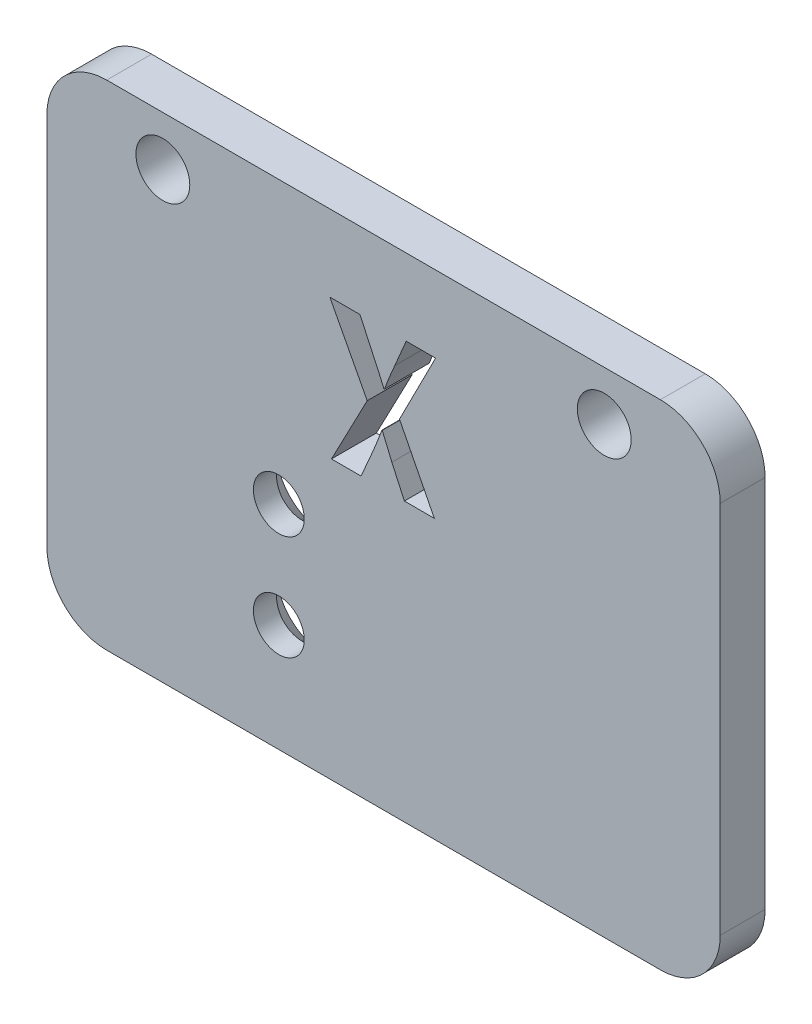
ISO-10303-21;
HEADER;
FILE_DESCRIPTION(('STEP AP214'),'2;1');
FILE_NAME('part.step','',(''),(''),'','','');
FILE_SCHEMA(('AUTOMOTIVE_DESIGN { 1 0 10303 214 1 1 1 1 }'));
ENDSEC;
DATA;
#1=APPLICATION_CONTEXT('core data for automotive mechanical design processes');
#2=APPLICATION_PROTOCOL_DEFINITION('international standard','automotive_design',2000,#1);
#3=PRODUCT_CONTEXT('',#1,'mechanical');
#4=PRODUCT('Part','Part','',(#3));
#5=PRODUCT_RELATED_PRODUCT_CATEGORY('part','',(#4));
#6=PRODUCT_DEFINITION_FORMATION('','',#4);
#7=PRODUCT_DEFINITION_CONTEXT('part definition',#1,'design');
#8=PRODUCT_DEFINITION('design','',#6,#7);
#9=PRODUCT_DEFINITION_SHAPE('','',#8);
#10=(LENGTH_UNIT() NAMED_UNIT(*) SI_UNIT(.MILLI.,.METRE.));
#11=(NAMED_UNIT(*) PLANE_ANGLE_UNIT() SI_UNIT($,.RADIAN.));
#12=(NAMED_UNIT(*) SI_UNIT($,.STERADIAN.) SOLID_ANGLE_UNIT());
#13=UNCERTAINTY_MEASURE_WITH_UNIT(LENGTH_MEASURE(1.E-05),#10,'distance_accuracy_value','');
#14=(GEOMETRIC_REPRESENTATION_CONTEXT(3) GLOBAL_UNCERTAINTY_ASSIGNED_CONTEXT((#13)) GLOBAL_UNIT_ASSIGNED_CONTEXT((#10,
#11,#12)) REPRESENTATION_CONTEXT('',''));
#15=CARTESIAN_POINT('',(0.,0.,0.));
#16=DIRECTION('',(0.,0.,1.));
#17=DIRECTION('',(1.,0.,0.));
#18=AXIS2_PLACEMENT_3D('',#15,#16,#17);
#19=CARTESIAN_POINT('',(0.,0.,3.));
#20=DIRECTION('',(0.,0.,1.));
#21=DIRECTION('',(1.,0.,0.));
#22=AXIS2_PLACEMENT_3D('',#19,#20,#21);
#23=PLANE('',#22);
#24=CARTESIAN_POINT('',(-7.00000000000006,-6.49999999999997,3.));
#25=DIRECTION('',(0.,0.,-1.));
#26=DIRECTION('',(-1.,0.,0.));
#27=AXIS2_PLACEMENT_3D('',#24,#25,#26);
#28=CIRCLE('',#27,1.7);
#29=CARTESIAN_POINT('',(-8.70000000000005,-6.49999999999997,3.));
#30=VERTEX_POINT('',#29);
#31=EDGE_CURVE('E816',#30,#30,#28,.T.);
#32=ORIENTED_EDGE('',*,*,#31,.T.);
#33=EDGE_LOOP('',(#32));
#34=FACE_BOUND('',#33,.T.);
#35=CARTESIAN_POINT('',(-14.75,16.0000000000112,3.));
#36=DIRECTION('',(0.,0.,1.));
#37=DIRECTION('',(1.,0.,0.));
#38=AXIS2_PLACEMENT_3D('',#35,#36,#37);
#39=CIRCLE('',#38,1.8);
#40=CARTESIAN_POINT('',(-12.95,16.0000000000112,3.));
#41=VERTEX_POINT('',#40);
#42=EDGE_CURVE('E831',#41,#41,#39,.T.);
#43=ORIENTED_EDGE('',*,*,#42,.F.);
#44=EDGE_LOOP('',(#43));
#45=FACE_BOUND('',#44,.T.);
#46=DIRECTION('',(1.,0.,0.));
#47=VECTOR('',#46,1.);
#48=CARTESIAN_POINT('',(-3.47999494411554,4.87964303541985,3.));
#49=LINE('',#48,#47);
#50=CARTESIAN_POINT('',(-3.47999494411554,4.87964303541985,3.));
#51=VERTEX_POINT('',#50);
#52=CARTESIAN_POINT('',(-1.50445461349458,4.87964303541985,3.));
#53=VERTEX_POINT('',#52);
#54=EDGE_CURVE('E217',#51,#53,#49,.T.);
#55=ORIENTED_EDGE('',*,*,#54,.F.);
#56=DIRECTION('',(-0.463406562768989,-0.886145787995762,0.));
#57=VECTOR('',#56,1.);
#58=CARTESIAN_POINT('',(-1.09237871630984,9.44534458910088,3.));
#59=LINE('',#58,#57);
#60=CARTESIAN_POINT('',(-1.09237871630984,9.44534458910088,3.));
#61=VERTEX_POINT('',#60);
#62=EDGE_CURVE('E207',#61,#51,#59,.T.);
#63=ORIENTED_EDGE('',*,*,#62,.F.);
#64=DIRECTION('',(0.465445905386361,-0.885076329566592,0.));
#65=VECTOR('',#64,1.);
#66=CARTESIAN_POINT('',(-3.58907385807621,14.1929763687532,3.));
#67=LINE('',#66,#65);
#68=CARTESIAN_POINT('',(-3.58907385807621,14.1929763687532,3.));
#69=VERTEX_POINT('',#68);
#70=EDGE_CURVE('E402',#69,#61,#67,.T.);
#71=ORIENTED_EDGE('',*,*,#70,.F.);
#72=DIRECTION('',(-1.,0.,0.));
#73=VECTOR('',#72,1.);
#74=CARTESIAN_POINT('',(-1.57717388946836,14.1929763687532,3.));
#75=LINE('',#74,#73);
#76=CARTESIAN_POINT('',(-1.57717388946836,14.1929763687532,3.));
#77=VERTEX_POINT('',#76);
#78=EDGE_CURVE('E475',#77,#69,#75,.T.);
#79=ORIENTED_EDGE('',*,*,#78,.F.);
#80=DIRECTION('',(-0.420330012233321,0.907371302618689,0.));
#81=VECTOR('',#80,1.);
#82=CARTESIAN_POINT('',(-0.740993097717341,12.3879031354512,3.));
#83=LINE('',#82,#81);
#84=CARTESIAN_POINT('',(-0.740993097717341,12.3879031354512,3.));
#85=VERTEX_POINT('',#84);
#86=EDGE_CURVE('E478',#85,#77,#83,.T.);
#87=ORIENTED_EDGE('',*,*,#86,.F.);
#88=CARTESIAN_POINT('',(0.0226501819547567,10.6928090618156,3.));
#89=CARTESIAN_POINT('',(-0.0350807577726407,10.8288788891608,3.));
#90=CARTESIAN_POINT('',(-0.15065561203542,11.1012848215643,3.));
#91=CARTESIAN_POINT('',(-0.32942300897568,11.5147460779507,3.));
#92=CARTESIAN_POINT('',(-0.526398164580095,11.9437350966133,3.));
#93=CARTESIAN_POINT('',(-0.667307197441242,12.2353882492087,3.));
#94=CARTESIAN_POINT('',(-0.740993097717341,12.3879031354512,3.));
#95=B_SPLINE_CURVE_WITH_KNOTS('',3,(#88,#89,#90,#91,#92,#93,#94),.UNSPECIFIED.,.F.,.F.,(4,1,1,1,
4),(0.,0.23847556166915,0.47741780084114,0.726724830683997,1.),.UNSPECIFIED.);
#96=CARTESIAN_POINT('',(0.0226501819547567,10.6928090618156,3.));
#97=VERTEX_POINT('',#96);
#98=EDGE_CURVE('E480',#97,#85,#95,.T.);
#99=ORIENTED_EDGE('',*,*,#98,.F.);
#100=DIRECTION('',(-0.999503272313926,0.0315152127353341,0.));
#101=VECTOR('',#100,1.);
#102=CARTESIAN_POINT('',(0.0579449578783624,10.6916961866481,3.));
#103=LINE('',#102,#101);
#104=CARTESIAN_POINT('',(0.0579449578783624,10.6916961866481,3.));
#105=VERTEX_POINT('',#104);
#106=EDGE_CURVE('E485',#105,#97,#103,.T.);
#107=ORIENTED_EDGE('',*,*,#106,.F.);
#108=CARTESIAN_POINT('',(0.749842941692536,12.4005031458232,3.));
#109=CARTESIAN_POINT('',(0.683388417426678,12.2471747960458,3.));
#110=CARTESIAN_POINT('',(0.555592526506366,11.9523155177706,3.));
#111=CARTESIAN_POINT('',(0.374121285114322,11.5207254866343,3.));
#112=CARTESIAN_POINT('',(0.206338491907835,11.1057202059059,3.));
#113=CARTESIAN_POINT('',(0.107367823790834,10.8295880006152,3.));
#114=CARTESIAN_POINT('',(0.0579449578783624,10.6916961866481,3.));
#115=B_SPLINE_CURVE_WITH_KNOTS('',3,(#108,#109,#110,#111,#112,#113,#114),.UNSPECIFIED.,.F.,.F.,
(4,1,1,1,4),(0.,0.271869227028428,0.522820236330614,0.76171130371579,1.),.UNSPECIFIED.);
#116=CARTESIAN_POINT('',(0.749842941692536,12.4005031458232,3.));
#117=VERTEX_POINT('',#116);
#118=EDGE_CURVE('E508',#117,#105,#115,.T.);
#119=ORIENTED_EDGE('',*,*,#118,.F.);
#120=DIRECTION('',(-0.391901851650741,-0.920007031860475,0.));
#121=VECTOR('',#120,1.);
#122=CARTESIAN_POINT('',(1.5133953394172,14.1929763687532,3.));
#123=LINE('',#122,#121);
#124=CARTESIAN_POINT('',(1.5133953394172,14.1929763687532,3.));
#125=VERTEX_POINT('',#124);
#126=EDGE_CURVE('E513',#125,#117,#123,.T.);
#127=ORIENTED_EDGE('',*,*,#126,.F.);
#128=DIRECTION('',(-1.,0.,0.));
#129=VECTOR('',#128,1.);
#130=CARTESIAN_POINT('',(3.4766991874559,14.1929763687532,3.));
#131=LINE('',#130,#129);
#132=CARTESIAN_POINT('',(3.4766991874559,14.1929763687532,3.));
#133=VERTEX_POINT('',#132);
#134=EDGE_CURVE('E518',#133,#125,#131,.T.);
#135=ORIENTED_EDGE('',*,*,#134,.F.);
#136=DIRECTION('',(0.453821859778633,0.891092430439774,0.));
#137=VECTOR('',#136,1.);
#138=CARTESIAN_POINT('',(1.06495980424557,9.45745589466121,3.));
#139=LINE('',#138,#137);
#140=CARTESIAN_POINT('',(1.06495980424557,9.45745589466121,3.));
#141=VERTEX_POINT('',#140);
#142=EDGE_CURVE('E520',#141,#133,#139,.T.);
#143=ORIENTED_EDGE('',*,*,#142,.F.);
#144=DIRECTION('',(-0.453140743986781,0.89143898621224,0.));
#145=VECTOR('',#144,1.);
#146=CARTESIAN_POINT('',(3.39197663540647,4.87964303541985,3.));
#147=LINE('',#146,#145);
#148=CARTESIAN_POINT('',(3.39197663540647,4.87964303541985,3.));
#149=VERTEX_POINT('',#148);
#150=EDGE_CURVE('E522',#149,#141,#147,.T.);
#151=ORIENTED_EDGE('',*,*,#150,.F.);
#152=DIRECTION('',(1.,0.,0.));
#153=VECTOR('',#152,1.);
#154=CARTESIAN_POINT('',(1.39219654612757,4.87964303541985,3.));
#155=LINE('',#154,#153);
#156=CARTESIAN_POINT('',(1.39219654612757,4.87964303541985,3.));
#157=VERTEX_POINT('',#156);
#158=EDGE_CURVE('E524',#157,#149,#155,.T.);
#159=ORIENTED_EDGE('',*,*,#158,.F.);
#160=DIRECTION('',(0.416466838917006,-0.90915090721094,0.));
#161=VECTOR('',#160,1.);
#162=CARTESIAN_POINT('',(0.554866869380745,6.70754135555651,3.));
#163=LINE('',#162,#161);
#164=CARTESIAN_POINT('',(0.554866869380745,6.70754135555651,3.));
#165=VERTEX_POINT('',#164);
#166=EDGE_CURVE('E526',#165,#157,#163,.T.);
#167=ORIENTED_EDGE('',*,*,#166,.F.);
#168=CARTESIAN_POINT('',(-0.0864287320059103,8.23421403306713,3.));
#169=CARTESIAN_POINT('',(0.0162161144216664,7.98064535586625,3.));
#170=CARTESIAN_POINT('',(0.223344012185761,7.46896699231103,3.));
#171=CARTESIAN_POINT('',(0.443707361643587,6.96284712746081,3.));
#172=CARTESIAN_POINT('',(0.554866869380745,6.70754135555651,3.));
#173=B_SPLINE_CURVE_WITH_KNOTS('',3,(#168,#169,#170,#171,#172),.UNSPECIFIED.,.F.,.F.,(4,1,4),
(0.,0.495562633211692,1.),.UNSPECIFIED.);
#174=CARTESIAN_POINT('',(-0.0864287320059103,8.23421403306713,3.));
#175=VERTEX_POINT('',#174);
#176=EDGE_CURVE('E527',#175,#165,#173,.T.);
#177=ORIENTED_EDGE('',*,*,#176,.F.);
#178=DIRECTION('',(0.999538326688741,0.0303831117608404,0.));
#179=VECTOR('',#178,1.);
#180=CARTESIAN_POINT('',(-0.112378100127754,8.23342524635358,3.));
#181=LINE('',#180,#179);
#182=CARTESIAN_POINT('',(-0.112378100127754,8.23342524635358,3.));
#183=VERTEX_POINT('',#182);
#184=EDGE_CURVE('E240',#183,#175,#181,.T.);
#185=ORIENTED_EDGE('',*,*,#184,.F.);
#186=CARTESIAN_POINT('',(-0.716662457111985,6.69607822690426,3.));
#187=CARTESIAN_POINT('',(-0.662988728428419,6.82384760319136,3.));
#188=CARTESIAN_POINT('',(-0.558253832398895,7.07316719900478,3.));
#189=CARTESIAN_POINT('',(-0.407159322969177,7.44847534747362,3.));
#190=CARTESIAN_POINT('',(-0.260246478933608,7.83350984413508,3.));
#191=CARTESIAN_POINT('',(-0.16305308538604,8.09637290781004,3.));
#192=CARTESIAN_POINT('',(-0.112378100127754,8.23342524635358,3.));
#193=B_SPLINE_CURVE_WITH_KNOTS('',3,(#186,#187,#188,#189,#190,#191,#192),.UNSPECIFIED.,.F.,.F.,
(4,1,1,1,4),(0.,0.251660768986101,0.491071984766718,0.734653573374272,1.),.UNSPECIFIED.);
#194=CARTESIAN_POINT('',(-0.716662457111985,6.69607822690426,3.));
#195=VERTEX_POINT('',#194);
#196=EDGE_CURVE('E232',#195,#183,#193,.T.);
#197=ORIENTED_EDGE('',*,*,#196,.F.);
#198=DIRECTION('',(0.397892421307903,0.917432079810672,0.));
#199=VECTOR('',#198,1.);
#200=CARTESIAN_POINT('',(-1.50445461349458,4.87964303541985,3.));
#201=LINE('',#200,#199);
#202=EDGE_CURVE('E230',#53,#195,#201,.T.);
#203=ORIENTED_EDGE('',*,*,#202,.F.);
#204=EDGE_LOOP('',(#55,#63,#71,#79,#87,#99,#107,#119,#127,#135,#143,#151,#159,#167,#177,#185,
#197,#203));
#205=FACE_BOUND('',#204,.T.);
#206=DIRECTION('',(1.,0.,0.));
#207=VECTOR('',#206,1.);
#208=CARTESIAN_POINT('',(-22.5,-13.7,3.));
#209=LINE('',#208,#207);
#210=CARTESIAN_POINT('',(-18.5,-13.7,3.));
#211=VERTEX_POINT('',#210);
#212=CARTESIAN_POINT('',(18.5,-13.7,3.));
#213=VERTEX_POINT('',#212);
#214=EDGE_CURVE('E355',#211,#213,#209,.T.);
#215=ORIENTED_EDGE('',*,*,#214,.T.);
#216=CARTESIAN_POINT('',(18.5,-9.7,3.));
#217=DIRECTION('',(0.,0.,1.));
#218=DIRECTION('',(1.,0.,0.));
#219=AXIS2_PLACEMENT_3D('',#216,#217,#218);
#220=CIRCLE('',#219,4.);
#221=CARTESIAN_POINT('',(22.5,-9.7,3.));
#222=VERTEX_POINT('',#221);
#223=EDGE_CURVE('E308',#213,#222,#220,.T.);
#224=ORIENTED_EDGE('',*,*,#223,.T.);
#225=DIRECTION('',(0.,1.,0.));
#226=VECTOR('',#225,1.);
#227=CARTESIAN_POINT('',(22.5,-13.7,3.));
#228=LINE('',#227,#226);
#229=CARTESIAN_POINT('',(22.5,15.3,3.));
#230=VERTEX_POINT('',#229);
#231=EDGE_CURVE('E362',#222,#230,#228,.T.);
#232=ORIENTED_EDGE('',*,*,#231,.T.);
#233=CARTESIAN_POINT('',(18.5,15.3,3.));
#234=DIRECTION('',(0.,0.,1.));
#235=DIRECTION('',(1.,0.,0.));
#236=AXIS2_PLACEMENT_3D('',#233,#234,#235);
#237=CIRCLE('',#236,4.);
#238=CARTESIAN_POINT('',(18.5,19.3,3.));
#239=VERTEX_POINT('',#238);
#240=EDGE_CURVE('E53',#230,#239,#237,.T.);
#241=ORIENTED_EDGE('',*,*,#240,.T.);
#242=DIRECTION('',(-1.,0.,0.));
#243=VECTOR('',#242,1.);
#244=CARTESIAN_POINT('',(22.5,19.3,3.));
#245=LINE('',#244,#243);
#246=CARTESIAN_POINT('',(-18.5,19.3,3.));
#247=VERTEX_POINT('',#246);
#248=EDGE_CURVE('E321',#239,#247,#245,.T.);
#249=ORIENTED_EDGE('',*,*,#248,.T.);
#250=CARTESIAN_POINT('',(-18.5,15.3,3.));
#251=DIRECTION('',(0.,0.,1.));
#252=DIRECTION('',(1.,0.,0.));
#253=AXIS2_PLACEMENT_3D('',#250,#251,#252);
#254=CIRCLE('',#253,4.);
#255=CARTESIAN_POINT('',(-22.5,15.3,3.));
#256=VERTEX_POINT('',#255);
#257=EDGE_CURVE('E301',#247,#256,#254,.T.);
#258=ORIENTED_EDGE('',*,*,#257,.T.);
#259=DIRECTION('',(0.,-1.,0.));
#260=VECTOR('',#259,1.);
#261=CARTESIAN_POINT('',(-22.5,-13.7,3.));
#262=LINE('',#261,#260);
#263=CARTESIAN_POINT('',(-22.5,-9.7,3.));
#264=VERTEX_POINT('',#263);
#265=EDGE_CURVE('E333',#256,#264,#262,.T.);
#266=ORIENTED_EDGE('',*,*,#265,.T.);
#267=CARTESIAN_POINT('',(-18.5,-9.7,3.));
#268=DIRECTION('',(0.,0.,1.));
#269=DIRECTION('',(1.,0.,0.));
#270=AXIS2_PLACEMENT_3D('',#267,#268,#269);
#271=CIRCLE('',#270,4.);
#272=EDGE_CURVE('E306',#264,#211,#271,.T.);
#273=ORIENTED_EDGE('',*,*,#272,.T.);
#274=EDGE_LOOP('',(#215,#224,#232,#241,#249,#258,#266,#273));
#275=FACE_BOUND('',#274,.T.);
#276=CARTESIAN_POINT('',(14.75,16.0000000000112,3.));
#277=DIRECTION('',(0.,0.,1.));
#278=DIRECTION('',(1.,0.,0.));
#279=AXIS2_PLACEMENT_3D('',#276,#277,#278);
#280=CIRCLE('',#279,1.8);
#281=CARTESIAN_POINT('',(16.55,16.0000000000112,3.));
#282=VERTEX_POINT('',#281);
#283=EDGE_CURVE('E473',#282,#282,#280,.T.);
#284=ORIENTED_EDGE('',*,*,#283,.F.);
#285=EDGE_LOOP('',(#284));
#286=FACE_BOUND('',#285,.T.);
#287=CARTESIAN_POINT('',(-7.00000000000006,0.500000000000028,3.));
#288=DIRECTION('',(0.,0.,-1.));
#289=DIRECTION('',(-1.,0.,0.));
#290=AXIS2_PLACEMENT_3D('',#287,#288,#289);
#291=CIRCLE('',#290,1.7);
#292=CARTESIAN_POINT('',(-8.70000000000005,0.500000000000028,3.));
#293=VERTEX_POINT('',#292);
#294=EDGE_CURVE('E827',#293,#293,#291,.T.);
#295=ORIENTED_EDGE('',*,*,#294,.T.);
#296=EDGE_LOOP('',(#295));
#297=FACE_BOUND('',#296,.T.);
#298=ADVANCED_FACE('F33',(#34,#45,#205,#275,#286,#297),#23,.T.);
#299=CARTESIAN_POINT('',(0.,0.,0.));
#300=DIRECTION('',(0.,0.,1.));
#301=DIRECTION('',(1.,0.,0.));
#302=AXIS2_PLACEMENT_3D('',#299,#300,#301);
#303=PLANE('',#302);
#304=CARTESIAN_POINT('',(-7.00000000000006,-6.49999999999997,0.));
#305=DIRECTION('',(0.,0.,-1.));
#306=DIRECTION('',(-1.,0.,0.));
#307=AXIS2_PLACEMENT_3D('',#304,#305,#306);
#308=CIRCLE('',#307,3.15);
#309=CARTESIAN_POINT('',(-10.1500000000001,-6.49999999999997,0.));
#310=VERTEX_POINT('',#309);
#311=EDGE_CURVE('E814',#310,#310,#308,.T.);
#312=ORIENTED_EDGE('',*,*,#311,.F.);
#313=EDGE_LOOP('',(#312));
#314=FACE_BOUND('',#313,.T.);
#315=DIRECTION('',(0.,1.,0.));
#316=VECTOR('',#315,1.);
#317=CARTESIAN_POINT('',(22.5,-9.69999999999999,0.));
#318=LINE('',#317,#316);
#319=CARTESIAN_POINT('',(22.5,-9.7,0.));
#320=VERTEX_POINT('',#319);
#321=CARTESIAN_POINT('',(22.5,15.3,0.));
#322=VERTEX_POINT('',#321);
#323=EDGE_CURVE('E330',#320,#322,#318,.T.);
#324=ORIENTED_EDGE('',*,*,#323,.F.);
#325=CARTESIAN_POINT('',(18.5,-9.7,0.));
#326=DIRECTION('',(0.,0.,1.));
#327=DIRECTION('',(1.,0.,0.));
#328=AXIS2_PLACEMENT_3D('',#325,#326,#327);
#329=CIRCLE('',#328,4.);
#330=CARTESIAN_POINT('',(18.5,-13.7,0.));
#331=VERTEX_POINT('',#330);
#332=EDGE_CURVE('E347',#320,#331,#329,.F.);
#333=ORIENTED_EDGE('',*,*,#332,.T.);
#334=DIRECTION('',(1.,0.,0.));
#335=VECTOR('',#334,1.);
#336=CARTESIAN_POINT('',(-22.5,-13.7,0.));
#337=LINE('',#336,#335);
#338=CARTESIAN_POINT('',(-18.5,-13.7,0.));
#339=VERTEX_POINT('',#338);
#340=EDGE_CURVE('E225',#339,#331,#337,.T.);
#341=ORIENTED_EDGE('',*,*,#340,.F.);
#342=CARTESIAN_POINT('',(-18.5,-9.7,0.));
#343=DIRECTION('',(0.,0.,1.));
#344=DIRECTION('',(1.,0.,0.));
#345=AXIS2_PLACEMENT_3D('',#342,#343,#344);
#346=CIRCLE('',#345,4.);
#347=CARTESIAN_POINT('',(-22.5,-9.7,0.));
#348=VERTEX_POINT('',#347);
#349=EDGE_CURVE('E345',#339,#348,#346,.F.);
#350=ORIENTED_EDGE('',*,*,#349,.T.);
#351=DIRECTION('',(0.,-1.,0.));
#352=VECTOR('',#351,1.);
#353=CARTESIAN_POINT('',(-22.5,-9.7,0.));
#354=LINE('',#353,#352);
#355=CARTESIAN_POINT('',(-22.5,15.3,0.));
#356=VERTEX_POINT('',#355);
#357=EDGE_CURVE('E329',#356,#348,#354,.T.);
#358=ORIENTED_EDGE('',*,*,#357,.F.);
#359=CARTESIAN_POINT('',(-18.5,15.3,0.));
#360=DIRECTION('',(0.,0.,1.));
#361=DIRECTION('',(1.,0.,0.));
#362=AXIS2_PLACEMENT_3D('',#359,#360,#361);
#363=CIRCLE('',#362,4.);
#364=CARTESIAN_POINT('',(-18.5,19.3,0.));
#365=VERTEX_POINT('',#364);
#366=EDGE_CURVE('E328',#356,#365,#363,.F.);
#367=ORIENTED_EDGE('',*,*,#366,.T.);
#368=DIRECTION('',(-1.,0.,0.));
#369=VECTOR('',#368,1.);
#370=CARTESIAN_POINT('',(22.5,19.3,0.));
#371=LINE('',#370,#369);
#372=CARTESIAN_POINT('',(18.5,19.3,0.));
#373=VERTEX_POINT('',#372);
#374=EDGE_CURVE('E320',#373,#365,#371,.T.);
#375=ORIENTED_EDGE('',*,*,#374,.F.);
#376=CARTESIAN_POINT('',(18.5,15.3,0.));
#377=DIRECTION('',(0.,0.,1.));
#378=DIRECTION('',(1.,0.,0.));
#379=AXIS2_PLACEMENT_3D('',#376,#377,#378);
#380=CIRCLE('',#379,4.);
#381=EDGE_CURVE('E325',#373,#322,#380,.F.);
#382=ORIENTED_EDGE('',*,*,#381,.T.);
#383=EDGE_LOOP('',(#324,#333,#341,#350,#358,#367,#375,#382));
#384=FACE_BOUND('',#383,.T.);
#385=DIRECTION('',(-0.463406562768989,-0.886145787995762,0.));
#386=VECTOR('',#385,1.);
#387=CARTESIAN_POINT('',(-1.09237871630984,9.44534458910088,0.));
#388=LINE('',#387,#386);
#389=CARTESIAN_POINT('',(-1.09237871630984,9.44534458910088,0.));
#390=VERTEX_POINT('',#389);
#391=CARTESIAN_POINT('',(-3.47999494411554,4.87964303541985,0.));
#392=VERTEX_POINT('',#391);
#393=EDGE_CURVE('E471',#390,#392,#388,.T.);
#394=ORIENTED_EDGE('',*,*,#393,.T.);
#395=DIRECTION('',(1.,0.,0.));
#396=VECTOR('',#395,1.);
#397=CARTESIAN_POINT('',(-3.47999494411554,4.87964303541985,0.));
#398=LINE('',#397,#396);
#399=CARTESIAN_POINT('',(-1.50445461349458,4.87964303541985,0.));
#400=VERTEX_POINT('',#399);
#401=EDGE_CURVE('E224',#392,#400,#398,.T.);
#402=ORIENTED_EDGE('',*,*,#401,.T.);
#403=DIRECTION('',(0.397892421307903,0.917432079810672,0.));
#404=VECTOR('',#403,1.);
#405=CARTESIAN_POINT('',(-1.50445461349458,4.87964303541985,0.));
#406=LINE('',#405,#404);
#407=CARTESIAN_POINT('',(-0.716662457111985,6.69607822690426,0.));
#408=VERTEX_POINT('',#407);
#409=EDGE_CURVE('E464',#400,#408,#406,.T.);
#410=ORIENTED_EDGE('',*,*,#409,.T.);
#411=CARTESIAN_POINT('',(-0.716662457111985,6.69607822690426,0.));
#412=CARTESIAN_POINT('',(-0.662988728428419,6.82384760319136,0.));
#413=CARTESIAN_POINT('',(-0.558253832398895,7.07316719900478,0.));
#414=CARTESIAN_POINT('',(-0.407159322969177,7.44847534747362,0.));
#415=CARTESIAN_POINT('',(-0.260246478933608,7.83350984413508,0.));
#416=CARTESIAN_POINT('',(-0.16305308538604,8.09637290781004,0.));
#417=CARTESIAN_POINT('',(-0.112378100127754,8.23342524635358,0.));
#418=B_SPLINE_CURVE_WITH_KNOTS('',3,(#411,#412,#413,#414,#415,#416,#417),.UNSPECIFIED.,.F.,.F.,
(4,1,1,1,4),(0.,0.251660768986101,0.491071984766718,0.734653573374272,1.),.UNSPECIFIED.);
#419=CARTESIAN_POINT('',(-0.112378100127754,8.23342524635358,0.));
#420=VERTEX_POINT('',#419);
#421=EDGE_CURVE('E459',#408,#420,#418,.T.);
#422=ORIENTED_EDGE('',*,*,#421,.T.);
#423=DIRECTION('',(0.999538326688741,0.0303831117608404,0.));
#424=VECTOR('',#423,1.);
#425=CARTESIAN_POINT('',(-0.112378100127754,8.23342524635358,0.));
#426=LINE('',#425,#424);
#427=CARTESIAN_POINT('',(-0.0864287320059103,8.23421403306713,0.));
#428=VERTEX_POINT('',#427);
#429=EDGE_CURVE('E453',#420,#428,#426,.T.);
#430=ORIENTED_EDGE('',*,*,#429,.T.);
#431=CARTESIAN_POINT('',(-0.0864287320059103,8.23421403306713,0.));
#432=CARTESIAN_POINT('',(0.0162161144216664,7.98064535586625,0.));
#433=CARTESIAN_POINT('',(0.223344012185761,7.46896699231103,0.));
#434=CARTESIAN_POINT('',(0.443707361643587,6.96284712746081,0.));
#435=CARTESIAN_POINT('',(0.554866869380745,6.70754135555651,0.));
#436=B_SPLINE_CURVE_WITH_KNOTS('',3,(#431,#432,#433,#434,#435),.UNSPECIFIED.,.F.,.F.,(4,1,4),
(0.,0.495562633211692,1.),.UNSPECIFIED.);
#437=CARTESIAN_POINT('',(0.554866869380745,6.70754135555651,0.));
#438=VERTEX_POINT('',#437);
#439=EDGE_CURVE('E448',#428,#438,#436,.T.);
#440=ORIENTED_EDGE('',*,*,#439,.T.);
#441=DIRECTION('',(0.416466838917006,-0.90915090721094,0.));
#442=VECTOR('',#441,1.);
#443=CARTESIAN_POINT('',(0.554866869380745,6.70754135555651,0.));
#444=LINE('',#443,#442);
#445=CARTESIAN_POINT('',(1.39219654612757,4.87964303541985,0.));
#446=VERTEX_POINT('',#445);
#447=EDGE_CURVE('E445',#438,#446,#444,.T.);
#448=ORIENTED_EDGE('',*,*,#447,.T.);
#449=DIRECTION('',(1.,0.,0.));
#450=VECTOR('',#449,1.);
#451=CARTESIAN_POINT('',(1.39219654612757,4.87964303541985,0.));
#452=LINE('',#451,#450);
#453=CARTESIAN_POINT('',(3.39197663540647,4.87964303541985,0.));
#454=VERTEX_POINT('',#453);
#455=EDGE_CURVE('E442',#446,#454,#452,.T.);
#456=ORIENTED_EDGE('',*,*,#455,.T.);
#457=DIRECTION('',(-0.453140743986781,0.89143898621224,0.));
#458=VECTOR('',#457,1.);
#459=CARTESIAN_POINT('',(3.39197663540647,4.87964303541985,0.));
#460=LINE('',#459,#458);
#461=CARTESIAN_POINT('',(1.06495980424557,9.45745589466121,0.));
#462=VERTEX_POINT('',#461);
#463=EDGE_CURVE('E439',#454,#462,#460,.T.);
#464=ORIENTED_EDGE('',*,*,#463,.T.);
#465=DIRECTION('',(0.453821859778633,0.891092430439774,0.));
#466=VECTOR('',#465,1.);
#467=CARTESIAN_POINT('',(1.06495980424557,9.45745589466121,0.));
#468=LINE('',#467,#466);
#469=CARTESIAN_POINT('',(3.4766991874559,14.1929763687532,0.));
#470=VERTEX_POINT('',#469);
#471=EDGE_CURVE('E436',#462,#470,#468,.T.);
#472=ORIENTED_EDGE('',*,*,#471,.T.);
#473=DIRECTION('',(-1.,0.,0.));
#474=VECTOR('',#473,1.);
#475=CARTESIAN_POINT('',(3.4766991874559,14.1929763687532,0.));
#476=LINE('',#475,#474);
#477=CARTESIAN_POINT('',(1.5133953394172,14.1929763687532,0.));
#478=VERTEX_POINT('',#477);
#479=EDGE_CURVE('E433',#470,#478,#476,.T.);
#480=ORIENTED_EDGE('',*,*,#479,.T.);
#481=DIRECTION('',(-0.391901851650741,-0.920007031860475,0.));
#482=VECTOR('',#481,1.);
#483=CARTESIAN_POINT('',(1.5133953394172,14.1929763687532,0.));
#484=LINE('',#483,#482);
#485=CARTESIAN_POINT('',(0.749842941692536,12.4005031458232,0.));
#486=VERTEX_POINT('',#485);
#487=EDGE_CURVE('E427',#478,#486,#484,.T.);
#488=ORIENTED_EDGE('',*,*,#487,.T.);
#489=CARTESIAN_POINT('',(0.749842941692536,12.4005031458232,0.));
#490=CARTESIAN_POINT('',(0.683388417426678,12.2471747960458,0.));
#491=CARTESIAN_POINT('',(0.555592526506366,11.9523155177706,0.));
#492=CARTESIAN_POINT('',(0.374121285114322,11.5207254866343,0.));
#493=CARTESIAN_POINT('',(0.206338491907835,11.1057202059059,0.));
#494=CARTESIAN_POINT('',(0.107367823790834,10.8295880006152,0.));
#495=CARTESIAN_POINT('',(0.0579449578783624,10.6916961866481,0.));
#496=B_SPLINE_CURVE_WITH_KNOTS('',3,(#489,#490,#491,#492,#493,#494,#495),.UNSPECIFIED.,.F.,.F.,
(4,1,1,1,4),(0.,0.271869227028428,0.522820236330614,0.76171130371579,1.),.UNSPECIFIED.);
#497=CARTESIAN_POINT('',(0.0579449578783624,10.6916961866481,0.));
#498=VERTEX_POINT('',#497);
#499=EDGE_CURVE('E422',#486,#498,#496,.T.);
#500=ORIENTED_EDGE('',*,*,#499,.T.);
#501=DIRECTION('',(-0.999503272313926,0.0315152127353341,0.));
#502=VECTOR('',#501,1.);
#503=CARTESIAN_POINT('',(0.0579449578783624,10.6916961866481,0.));
#504=LINE('',#503,#502);
#505=CARTESIAN_POINT('',(0.0226501819547567,10.6928090618156,0.));
#506=VERTEX_POINT('',#505);
#507=EDGE_CURVE('E416',#498,#506,#504,.T.);
#508=ORIENTED_EDGE('',*,*,#507,.T.);
#509=CARTESIAN_POINT('',(0.0226501819547567,10.6928090618156,0.));
#510=CARTESIAN_POINT('',(-0.0350807577726407,10.8288788891608,0.));
#511=CARTESIAN_POINT('',(-0.15065561203542,11.1012848215643,0.));
#512=CARTESIAN_POINT('',(-0.32942300897568,11.5147460779507,0.));
#513=CARTESIAN_POINT('',(-0.526398164580095,11.9437350966133,0.));
#514=CARTESIAN_POINT('',(-0.667307197441242,12.2353882492087,0.));
#515=CARTESIAN_POINT('',(-0.740993097717341,12.3879031354512,0.));
#516=B_SPLINE_CURVE_WITH_KNOTS('',3,(#509,#510,#511,#512,#513,#514,#515),.UNSPECIFIED.,.F.,.F.,
(4,1,1,1,4),(0.,0.23847556166915,0.47741780084114,0.726724830683997,1.),.UNSPECIFIED.);
#517=CARTESIAN_POINT('',(-0.740993097717341,12.3879031354512,0.));
#518=VERTEX_POINT('',#517);
#519=EDGE_CURVE('E411',#506,#518,#516,.T.);
#520=ORIENTED_EDGE('',*,*,#519,.T.);
#521=DIRECTION('',(-0.420330012233321,0.907371302618689,0.));
#522=VECTOR('',#521,1.);
#523=CARTESIAN_POINT('',(-0.740993097717341,12.3879031354512,0.));
#524=LINE('',#523,#522);
#525=CARTESIAN_POINT('',(-1.57717388946836,14.1929763687532,0.));
#526=VERTEX_POINT('',#525);
#527=EDGE_CURVE('E408',#518,#526,#524,.T.);
#528=ORIENTED_EDGE('',*,*,#527,.T.);
#529=DIRECTION('',(-1.,0.,0.));
#530=VECTOR('',#529,1.);
#531=CARTESIAN_POINT('',(-1.57717388946836,14.1929763687532,0.));
#532=LINE('',#531,#530);
#533=CARTESIAN_POINT('',(-3.58907385807621,14.1929763687532,0.));
#534=VERTEX_POINT('',#533);
#535=EDGE_CURVE('E405',#526,#534,#532,.T.);
#536=ORIENTED_EDGE('',*,*,#535,.T.);
#537=DIRECTION('',(0.465445905386361,-0.885076329566592,0.));
#538=VECTOR('',#537,1.);
#539=CARTESIAN_POINT('',(-3.58907385807621,14.1929763687532,0.));
#540=LINE('',#539,#538);
#541=EDGE_CURVE('E218',#534,#390,#540,.T.);
#542=ORIENTED_EDGE('',*,*,#541,.T.);
#543=EDGE_LOOP('',(#394,#402,#410,#422,#430,#440,#448,#456,#464,#472,#480,#488,#500,#508,#520,
#528,#536,#542));
#544=FACE_BOUND('',#543,.T.);
#545=CARTESIAN_POINT('',(14.75,16.0000000000112,0.));
#546=DIRECTION('',(0.,0.,1.));
#547=DIRECTION('',(1.,0.,0.));
#548=AXIS2_PLACEMENT_3D('',#545,#546,#547);
#549=CIRCLE('',#548,1.8);
#550=CARTESIAN_POINT('',(16.55,16.0000000000112,0.));
#551=VERTEX_POINT('',#550);
#552=EDGE_CURVE('E834',#551,#551,#549,.T.);
#553=ORIENTED_EDGE('',*,*,#552,.T.);
#554=EDGE_LOOP('',(#553));
#555=FACE_BOUND('',#554,.T.);
#556=CARTESIAN_POINT('',(-14.75,16.0000000000112,0.));
#557=DIRECTION('',(0.,0.,1.));
#558=DIRECTION('',(1.,0.,0.));
#559=AXIS2_PLACEMENT_3D('',#556,#557,#558);
#560=CIRCLE('',#559,1.8);
#561=CARTESIAN_POINT('',(-12.95,16.0000000000112,0.));
#562=VERTEX_POINT('',#561);
#563=EDGE_CURVE('E830',#562,#562,#560,.T.);
#564=ORIENTED_EDGE('',*,*,#563,.T.);
#565=EDGE_LOOP('',(#564));
#566=FACE_BOUND('',#565,.T.);
#567=CARTESIAN_POINT('',(-7.00000000000006,0.500000000000028,0.));
#568=DIRECTION('',(0.,0.,-1.));
#569=DIRECTION('',(-1.,0.,0.));
#570=AXIS2_PLACEMENT_3D('',#567,#568,#569);
#571=CIRCLE('',#570,3.15);
#572=CARTESIAN_POINT('',(-10.1500000000001,0.500000000000028,0.));
#573=VERTEX_POINT('',#572);
#574=EDGE_CURVE('E821',#573,#573,#571,.T.);
#575=ORIENTED_EDGE('',*,*,#574,.F.);
#576=EDGE_LOOP('',(#575));
#577=FACE_BOUND('',#576,.T.);
#578=ADVANCED_FACE('F264',(#314,#384,#544,#555,#566,#577),#303,.F.);
#579=CARTESIAN_POINT('',(-22.5,-13.7,3.));
#580=DIRECTION('',(0.,1.,0.));
#581=DIRECTION('',(0.,0.,1.));
#582=AXIS2_PLACEMENT_3D('',#579,#580,#581);
#583=PLANE('',#582);
#584=ORIENTED_EDGE('',*,*,#340,.T.);
#585=DIRECTION('',(0.,0.,-1.));
#586=VECTOR('',#585,1.);
#587=CARTESIAN_POINT('',(18.5,-13.7,3.));
#588=LINE('',#587,#586);
#589=EDGE_CURVE('E310',#331,#213,#588,.F.);
#590=ORIENTED_EDGE('',*,*,#589,.T.);
#591=ORIENTED_EDGE('',*,*,#214,.F.);
#592=DIRECTION('',(0.,0.,-1.));
#593=VECTOR('',#592,1.);
#594=CARTESIAN_POINT('',(-18.5,-13.7,3.));
#595=LINE('',#594,#593);
#596=EDGE_CURVE('E349',#211,#339,#595,.T.);
#597=ORIENTED_EDGE('',*,*,#596,.T.);
#598=EDGE_LOOP('',(#584,#590,#591,#597));
#599=FACE_BOUND('',#598,.T.);
#600=ADVANCED_FACE('F268',(#599),#583,.F.);
#601=CARTESIAN_POINT('',(22.5,-9.69999999999999,3.));
#602=DIRECTION('',(-1.,0.,0.));
#603=DIRECTION('',(0.,0.,1.));
#604=AXIS2_PLACEMENT_3D('',#601,#602,#603);
#605=PLANE('',#604);
#606=ORIENTED_EDGE('',*,*,#231,.F.);
#607=DIRECTION('',(0.,0.,-1.));
#608=VECTOR('',#607,1.);
#609=CARTESIAN_POINT('',(22.5,-9.7,3.));
#610=LINE('',#609,#608);
#611=EDGE_CURVE('E340',#222,#320,#610,.T.);
#612=ORIENTED_EDGE('',*,*,#611,.T.);
#613=ORIENTED_EDGE('',*,*,#323,.T.);
#614=DIRECTION('',(0.,0.,-1.));
#615=VECTOR('',#614,1.);
#616=CARTESIAN_POINT('',(22.5,15.3,3.));
#617=LINE('',#616,#615);
#618=EDGE_CURVE('E338',#322,#230,#617,.F.);
#619=ORIENTED_EDGE('',*,*,#618,.T.);
#620=EDGE_LOOP('',(#606,#612,#613,#619));
#621=FACE_BOUND('',#620,.T.);
#622=ADVANCED_FACE('F276',(#621),#605,.F.);
#623=CARTESIAN_POINT('',(22.5,19.3,3.));
#624=DIRECTION('',(0.,-1.,0.));
#625=DIRECTION('',(1.,0.,0.));
#626=AXIS2_PLACEMENT_3D('',#623,#624,#625);
#627=PLANE('',#626);
#628=ORIENTED_EDGE('',*,*,#374,.T.);
#629=DIRECTION('',(0.,0.,-1.));
#630=VECTOR('',#629,1.);
#631=CARTESIAN_POINT('',(-18.5,19.3,3.));
#632=LINE('',#631,#630);
#633=EDGE_CURVE('E11',#365,#247,#632,.F.);
#634=ORIENTED_EDGE('',*,*,#633,.T.);
#635=ORIENTED_EDGE('',*,*,#248,.F.);
#636=DIRECTION('',(0.,0.,-1.));
#637=VECTOR('',#636,1.);
#638=CARTESIAN_POINT('',(18.5,19.3,3.));
#639=LINE('',#638,#637);
#640=EDGE_CURVE('E41',#239,#373,#639,.T.);
#641=ORIENTED_EDGE('',*,*,#640,.T.);
#642=EDGE_LOOP('',(#628,#634,#635,#641));
#643=FACE_BOUND('',#642,.T.);
#644=ADVANCED_FACE('F272',(#643),#627,.F.);
#645=CARTESIAN_POINT('',(-22.5,-9.7,3.));
#646=DIRECTION('',(1.,0.,0.));
#647=DIRECTION('',(0.,0.,-1.));
#648=AXIS2_PLACEMENT_3D('',#645,#646,#647);
#649=PLANE('',#648);
#650=ORIENTED_EDGE('',*,*,#357,.T.);
#651=DIRECTION('',(0.,0.,-1.));
#652=VECTOR('',#651,1.);
#653=CARTESIAN_POINT('',(-22.5,-9.7,3.));
#654=LINE('',#653,#652);
#655=EDGE_CURVE('E316',#348,#264,#654,.F.);
#656=ORIENTED_EDGE('',*,*,#655,.T.);
#657=ORIENTED_EDGE('',*,*,#265,.F.);
#658=DIRECTION('',(0.,0.,-1.));
#659=VECTOR('',#658,1.);
#660=CARTESIAN_POINT('',(-22.5,15.3,3.));
#661=LINE('',#660,#659);
#662=EDGE_CURVE('E303',#256,#356,#661,.T.);
#663=ORIENTED_EDGE('',*,*,#662,.T.);
#664=EDGE_LOOP('',(#650,#656,#657,#663));
#665=FACE_BOUND('',#664,.T.);
#666=ADVANCED_FACE('F261',(#665),#649,.F.);
#667=CARTESIAN_POINT('',(-1.09237871630984,9.44534458910088,3.));
#668=DIRECTION('',(0.886145787995763,-0.463406562768989,0.));
#669=DIRECTION('',(0.463406562768989,0.886145787995763,0.));
#670=AXIS2_PLACEMENT_3D('',#667,#668,#669);
#671=PLANE('',#670);
#672=ORIENTED_EDGE('',*,*,#393,.F.);
#673=DIRECTION('',(0.,0.,-1.));
#674=VECTOR('',#673,1.);
#675=CARTESIAN_POINT('',(-1.09237871630984,9.44534458910088,3.));
#676=LINE('',#675,#674);
#677=EDGE_CURVE('E213',#61,#390,#676,.T.);
#678=ORIENTED_EDGE('',*,*,#677,.F.);
#679=ORIENTED_EDGE('',*,*,#62,.T.);
#680=DIRECTION('',(0.,0.,-1.));
#681=VECTOR('',#680,1.);
#682=CARTESIAN_POINT('',(-3.47999494411554,4.87964303541985,3.));
#683=LINE('',#682,#681);
#684=EDGE_CURVE('E210',#51,#392,#683,.T.);
#685=ORIENTED_EDGE('',*,*,#684,.T.);
#686=EDGE_LOOP('',(#672,#678,#679,#685));
#687=FACE_BOUND('',#686,.T.);
#688=ADVANCED_FACE('F209',(#687),#671,.T.);
#689=CARTESIAN_POINT('',(-3.47999494411554,4.87964303541985,3.));
#690=DIRECTION('',(0.,1.,0.));
#691=DIRECTION('',(0.,0.,1.));
#692=AXIS2_PLACEMENT_3D('',#689,#690,#691);
#693=PLANE('',#692);
#694=ORIENTED_EDGE('',*,*,#401,.F.);
#695=ORIENTED_EDGE('',*,*,#684,.F.);
#696=ORIENTED_EDGE('',*,*,#54,.T.);
#697=DIRECTION('',(0.,0.,-1.));
#698=VECTOR('',#697,1.);
#699=CARTESIAN_POINT('',(-1.50445461349458,4.87964303541985,3.));
#700=LINE('',#699,#698);
#701=EDGE_CURVE('E226',#53,#400,#700,.T.);
#702=ORIENTED_EDGE('',*,*,#701,.T.);
#703=EDGE_LOOP('',(#694,#695,#696,#702));
#704=FACE_BOUND('',#703,.T.);
#705=ADVANCED_FACE('F221',(#704),#693,.T.);
#706=CARTESIAN_POINT('',(-1.50445461349458,4.87964303541985,3.));
#707=DIRECTION('',(-0.917432079810671,0.397892421307903,0.));
#708=DIRECTION('',(-0.397892421307903,-0.917432079810672,0.));
#709=AXIS2_PLACEMENT_3D('',#706,#707,#708);
#710=PLANE('',#709);
#711=ORIENTED_EDGE('',*,*,#409,.F.);
#712=ORIENTED_EDGE('',*,*,#701,.F.);
#713=ORIENTED_EDGE('',*,*,#202,.T.);
#714=DIRECTION('',(0.,0.,-1.));
#715=VECTOR('',#714,1.);
#716=CARTESIAN_POINT('',(-0.716662457111985,6.69607822690426,3.));
#717=LINE('',#716,#715);
#718=EDGE_CURVE('E371',#195,#408,#717,.T.);
#719=ORIENTED_EDGE('',*,*,#718,.T.);
#720=EDGE_LOOP('',(#711,#712,#713,#719));
#721=FACE_BOUND('',#720,.T.);
#722=ADVANCED_FACE('F251',(#721),#710,.T.);
#723=DIRECTION('',(0.,0.,-1.));
#724=VECTOR('',#723,1.);
#725=SURFACE_OF_LINEAR_EXTRUSION('',#193,#724);
#726=ORIENTED_EDGE('',*,*,#421,.F.);
#727=ORIENTED_EDGE('',*,*,#718,.F.);
#728=ORIENTED_EDGE('',*,*,#196,.T.);
#729=DIRECTION('',(0.,0.,-1.));
#730=VECTOR('',#729,1.);
#731=CARTESIAN_POINT('',(-0.112378100127754,8.23342524635358,3.));
#732=LINE('',#731,#730);
#733=EDGE_CURVE('E373',#183,#420,#732,.T.);
#734=ORIENTED_EDGE('',*,*,#733,.T.);
#735=EDGE_LOOP('',(#726,#727,#728,#734));
#736=FACE_BOUND('',#735,.T.);
#737=ADVANCED_FACE('F246',(#736),#725,.T.);
#738=CARTESIAN_POINT('',(-0.112378100127754,8.23342524635358,3.));
#739=DIRECTION('',(-0.0303831117608404,0.999538326688741,0.));
#740=DIRECTION('',(-0.999538326688741,-0.0303831117608404,0.));
#741=AXIS2_PLACEMENT_3D('',#738,#739,#740);
#742=PLANE('',#741);
#743=ORIENTED_EDGE('',*,*,#429,.F.);
#744=ORIENTED_EDGE('',*,*,#733,.F.);
#745=ORIENTED_EDGE('',*,*,#184,.T.);
#746=DIRECTION('',(0.,0.,-1.));
#747=VECTOR('',#746,1.);
#748=CARTESIAN_POINT('',(-0.0864287320059103,8.23421403306713,3.));
#749=LINE('',#748,#747);
#750=EDGE_CURVE('E375',#175,#428,#749,.T.);
#751=ORIENTED_EDGE('',*,*,#750,.T.);
#752=EDGE_LOOP('',(#743,#744,#745,#751));
#753=FACE_BOUND('',#752,.T.);
#754=ADVANCED_FACE('F250',(#753),#742,.T.);
#755=DIRECTION('',(0.,0.,-1.));
#756=VECTOR('',#755,1.);
#757=SURFACE_OF_LINEAR_EXTRUSION('',#173,#756);
#758=ORIENTED_EDGE('',*,*,#439,.F.);
#759=ORIENTED_EDGE('',*,*,#750,.F.);
#760=ORIENTED_EDGE('',*,*,#176,.T.);
#761=DIRECTION('',(0.,0.,-1.));
#762=VECTOR('',#761,1.);
#763=CARTESIAN_POINT('',(0.554866869380745,6.70754135555651,3.));
#764=LINE('',#763,#762);
#765=EDGE_CURVE('E377',#165,#438,#764,.T.);
#766=ORIENTED_EDGE('',*,*,#765,.T.);
#767=EDGE_LOOP('',(#758,#759,#760,#766));
#768=FACE_BOUND('',#767,.T.);
#769=ADVANCED_FACE('F534',(#768),#757,.T.);
#770=CARTESIAN_POINT('',(0.554866869380745,6.70754135555651,3.));
#771=DIRECTION('',(0.90915090721094,0.416466838917006,0.));
#772=DIRECTION('',(-0.416466838917007,0.909150907210941,0.));
#773=AXIS2_PLACEMENT_3D('',#770,#771,#772);
#774=PLANE('',#773);
#775=ORIENTED_EDGE('',*,*,#447,.F.);
#776=ORIENTED_EDGE('',*,*,#765,.F.);
#777=ORIENTED_EDGE('',*,*,#166,.T.);
#778=DIRECTION('',(0.,0.,-1.));
#779=VECTOR('',#778,1.);
#780=CARTESIAN_POINT('',(1.39219654612757,4.87964303541985,3.));
#781=LINE('',#780,#779);
#782=EDGE_CURVE('E379',#157,#446,#781,.T.);
#783=ORIENTED_EDGE('',*,*,#782,.T.);
#784=EDGE_LOOP('',(#775,#776,#777,#783));
#785=FACE_BOUND('',#784,.T.);
#786=ADVANCED_FACE('F537',(#785),#774,.T.);
#787=CARTESIAN_POINT('',(1.39219654612757,4.87964303541985,3.));
#788=DIRECTION('',(0.,1.,0.));
#789=DIRECTION('',(0.,0.,1.));
#790=AXIS2_PLACEMENT_3D('',#787,#788,#789);
#791=PLANE('',#790);
#792=ORIENTED_EDGE('',*,*,#455,.F.);
#793=ORIENTED_EDGE('',*,*,#782,.F.);
#794=ORIENTED_EDGE('',*,*,#158,.T.);
#795=DIRECTION('',(0.,0.,-1.));
#796=VECTOR('',#795,1.);
#797=CARTESIAN_POINT('',(3.39197663540647,4.87964303541985,3.));
#798=LINE('',#797,#796);
#799=EDGE_CURVE('E381',#149,#454,#798,.T.);
#800=ORIENTED_EDGE('',*,*,#799,.T.);
#801=EDGE_LOOP('',(#792,#793,#794,#800));
#802=FACE_BOUND('',#801,.T.);
#803=ADVANCED_FACE('F541',(#802),#791,.T.);
#804=CARTESIAN_POINT('',(3.39197663540647,4.87964303541985,3.));
#805=DIRECTION('',(-0.89143898621224,-0.453140743986781,0.));
#806=DIRECTION('',(0.453140743986781,-0.89143898621224,0.));
#807=AXIS2_PLACEMENT_3D('',#804,#805,#806);
#808=PLANE('',#807);
#809=ORIENTED_EDGE('',*,*,#463,.F.);
#810=ORIENTED_EDGE('',*,*,#799,.F.);
#811=ORIENTED_EDGE('',*,*,#150,.T.);
#812=DIRECTION('',(0.,0.,-1.));
#813=VECTOR('',#812,1.);
#814=CARTESIAN_POINT('',(1.06495980424557,9.45745589466121,3.));
#815=LINE('',#814,#813);
#816=EDGE_CURVE('E383',#141,#462,#815,.T.);
#817=ORIENTED_EDGE('',*,*,#816,.T.);
#818=EDGE_LOOP('',(#809,#810,#811,#817));
#819=FACE_BOUND('',#818,.T.);
#820=ADVANCED_FACE('F545',(#819),#808,.T.);
#821=CARTESIAN_POINT('',(1.06495980424557,9.45745589466121,3.));
#822=DIRECTION('',(-0.891092430439774,0.453821859778633,0.));
#823=DIRECTION('',(-0.453821859778633,-0.891092430439774,0.));
#824=AXIS2_PLACEMENT_3D('',#821,#822,#823);
#825=PLANE('',#824);
#826=ORIENTED_EDGE('',*,*,#471,.F.);
#827=ORIENTED_EDGE('',*,*,#816,.F.);
#828=ORIENTED_EDGE('',*,*,#142,.T.);
#829=DIRECTION('',(0.,0.,-1.));
#830=VECTOR('',#829,1.);
#831=CARTESIAN_POINT('',(3.4766991874559,14.1929763687532,3.));
#832=LINE('',#831,#830);
#833=EDGE_CURVE('E385',#133,#470,#832,.T.);
#834=ORIENTED_EDGE('',*,*,#833,.T.);
#835=EDGE_LOOP('',(#826,#827,#828,#834));
#836=FACE_BOUND('',#835,.T.);
#837=ADVANCED_FACE('F549',(#836),#825,.T.);
#838=CARTESIAN_POINT('',(3.4766991874559,14.1929763687532,3.));
#839=DIRECTION('',(0.,-1.,0.));
#840=DIRECTION('',(0.,0.,-1.));
#841=AXIS2_PLACEMENT_3D('',#838,#839,#840);
#842=PLANE('',#841);
#843=ORIENTED_EDGE('',*,*,#479,.F.);
#844=ORIENTED_EDGE('',*,*,#833,.F.);
#845=ORIENTED_EDGE('',*,*,#134,.T.);
#846=DIRECTION('',(0.,0.,-1.));
#847=VECTOR('',#846,1.);
#848=CARTESIAN_POINT('',(1.5133953394172,14.1929763687532,3.));
#849=LINE('',#848,#847);
#850=EDGE_CURVE('E387',#125,#478,#849,.T.);
#851=ORIENTED_EDGE('',*,*,#850,.T.);
#852=EDGE_LOOP('',(#843,#844,#845,#851));
#853=FACE_BOUND('',#852,.T.);
#854=ADVANCED_FACE('F552',(#853),#842,.T.);
#855=CARTESIAN_POINT('',(1.5133953394172,14.1929763687532,3.));
#856=DIRECTION('',(0.920007031860475,-0.391901851650741,0.));
#857=DIRECTION('',(0.391901851650741,0.920007031860475,0.));
#858=AXIS2_PLACEMENT_3D('',#855,#856,#857);
#859=PLANE('',#858);
#860=ORIENTED_EDGE('',*,*,#487,.F.);
#861=ORIENTED_EDGE('',*,*,#850,.F.);
#862=ORIENTED_EDGE('',*,*,#126,.T.);
#863=DIRECTION('',(0.,0.,-1.));
#864=VECTOR('',#863,1.);
#865=CARTESIAN_POINT('',(0.749842941692536,12.4005031458232,3.));
#866=LINE('',#865,#864);
#867=EDGE_CURVE('E389',#117,#486,#866,.T.);
#868=ORIENTED_EDGE('',*,*,#867,.T.);
#869=EDGE_LOOP('',(#860,#861,#862,#868));
#870=FACE_BOUND('',#869,.T.);
#871=ADVANCED_FACE('F505',(#870),#859,.T.);
#872=DIRECTION('',(0.,0.,-1.));
#873=VECTOR('',#872,1.);
#874=SURFACE_OF_LINEAR_EXTRUSION('',#115,#873);
#875=ORIENTED_EDGE('',*,*,#499,.F.);
#876=ORIENTED_EDGE('',*,*,#867,.F.);
#877=ORIENTED_EDGE('',*,*,#118,.T.);
#878=DIRECTION('',(0.,0.,-1.));
#879=VECTOR('',#878,1.);
#880=CARTESIAN_POINT('',(0.0579449578783624,10.6916961866481,3.));
#881=LINE('',#880,#879);
#882=EDGE_CURVE('E391',#105,#498,#881,.T.);
#883=ORIENTED_EDGE('',*,*,#882,.T.);
#884=EDGE_LOOP('',(#875,#876,#877,#883));
#885=FACE_BOUND('',#884,.T.);
#886=ADVANCED_FACE('F501',(#885),#874,.T.);
#887=CARTESIAN_POINT('',(0.0579449578783624,10.6916961866481,3.));
#888=DIRECTION('',(-0.0315152127353341,-0.999503272313926,0.));
#889=DIRECTION('',(0.999503272313926,-0.0315152127353341,0.));
#890=AXIS2_PLACEMENT_3D('',#887,#888,#889);
#891=PLANE('',#890);
#892=ORIENTED_EDGE('',*,*,#507,.F.);
#893=ORIENTED_EDGE('',*,*,#882,.F.);
#894=ORIENTED_EDGE('',*,*,#106,.T.);
#895=DIRECTION('',(0.,0.,-1.));
#896=VECTOR('',#895,1.);
#897=CARTESIAN_POINT('',(0.0226501819547567,10.6928090618156,3.));
#898=LINE('',#897,#896);
#899=EDGE_CURVE('E393',#97,#506,#898,.T.);
#900=ORIENTED_EDGE('',*,*,#899,.T.);
#901=EDGE_LOOP('',(#892,#893,#894,#900));
#902=FACE_BOUND('',#901,.T.);
#903=ADVANCED_FACE('F496',(#902),#891,.T.);
#904=DIRECTION('',(0.,0.,-1.));
#905=VECTOR('',#904,1.);
#906=SURFACE_OF_LINEAR_EXTRUSION('',#95,#905);
#907=ORIENTED_EDGE('',*,*,#519,.F.);
#908=ORIENTED_EDGE('',*,*,#899,.F.);
#909=ORIENTED_EDGE('',*,*,#98,.T.);
#910=DIRECTION('',(0.,0.,-1.));
#911=VECTOR('',#910,1.);
#912=CARTESIAN_POINT('',(-0.740993097717341,12.3879031354512,3.));
#913=LINE('',#912,#911);
#914=EDGE_CURVE('E395',#85,#518,#913,.T.);
#915=ORIENTED_EDGE('',*,*,#914,.T.);
#916=EDGE_LOOP('',(#907,#908,#909,#915));
#917=FACE_BOUND('',#916,.T.);
#918=ADVANCED_FACE('F491',(#917),#906,.T.);
#919=CARTESIAN_POINT('',(-0.740993097717341,12.3879031354512,3.));
#920=DIRECTION('',(-0.907371302618689,-0.420330012233321,0.));
#921=DIRECTION('',(0.420330012233321,-0.907371302618689,0.));
#922=AXIS2_PLACEMENT_3D('',#919,#920,#921);
#923=PLANE('',#922);
#924=ORIENTED_EDGE('',*,*,#527,.F.);
#925=ORIENTED_EDGE('',*,*,#914,.F.);
#926=ORIENTED_EDGE('',*,*,#86,.T.);
#927=DIRECTION('',(0.,0.,-1.));
#928=VECTOR('',#927,1.);
#929=CARTESIAN_POINT('',(-1.57717388946836,14.1929763687532,3.));
#930=LINE('',#929,#928);
#931=EDGE_CURVE('E397',#77,#526,#930,.T.);
#932=ORIENTED_EDGE('',*,*,#931,.T.);
#933=EDGE_LOOP('',(#924,#925,#926,#932));
#934=FACE_BOUND('',#933,.T.);
#935=ADVANCED_FACE('F495',(#934),#923,.T.);
#936=CARTESIAN_POINT('',(-1.57717388946836,14.1929763687532,3.));
#937=DIRECTION('',(0.,-1.,0.));
#938=DIRECTION('',(0.,0.,-1.));
#939=AXIS2_PLACEMENT_3D('',#936,#937,#938);
#940=PLANE('',#939);
#941=ORIENTED_EDGE('',*,*,#535,.F.);
#942=ORIENTED_EDGE('',*,*,#931,.F.);
#943=ORIENTED_EDGE('',*,*,#78,.T.);
#944=DIRECTION('',(0.,0.,-1.));
#945=VECTOR('',#944,1.);
#946=CARTESIAN_POINT('',(-3.58907385807621,14.1929763687532,3.));
#947=LINE('',#946,#945);
#948=EDGE_CURVE('E399',#69,#534,#947,.T.);
#949=ORIENTED_EDGE('',*,*,#948,.T.);
#950=EDGE_LOOP('',(#941,#942,#943,#949));
#951=FACE_BOUND('',#950,.T.);
#952=ADVANCED_FACE('F590',(#951),#940,.T.);
#953=CARTESIAN_POINT('',(-3.58907385807621,14.1929763687532,3.));
#954=DIRECTION('',(0.885076329566592,0.465445905386361,0.));
#955=DIRECTION('',(-0.465445905386361,0.885076329566592,0.));
#956=AXIS2_PLACEMENT_3D('',#953,#954,#955);
#957=PLANE('',#956);
#958=ORIENTED_EDGE('',*,*,#541,.F.);
#959=ORIENTED_EDGE('',*,*,#948,.F.);
#960=ORIENTED_EDGE('',*,*,#70,.T.);
#961=ORIENTED_EDGE('',*,*,#677,.T.);
#962=EDGE_LOOP('',(#958,#959,#960,#961));
#963=FACE_BOUND('',#962,.T.);
#964=ADVANCED_FACE('F593',(#963),#957,.T.);
#965=CARTESIAN_POINT('',(14.75,16.0000000000112,3.));
#966=DIRECTION('',(0.,0.,-1.));
#967=DIRECTION('',(-1.,0.,0.));
#968=AXIS2_PLACEMENT_3D('',#965,#966,#967);
#969=CYLINDRICAL_SURFACE('',#968,1.8);
#970=ORIENTED_EDGE('',*,*,#283,.T.);
#971=EDGE_LOOP('',(#970));
#972=FACE_BOUND('',#971,.T.);
#973=ORIENTED_EDGE('',*,*,#552,.F.);
#974=EDGE_LOOP('',(#973));
#975=FACE_BOUND('',#974,.T.);
#976=ADVANCED_FACE('F686',(#972,#975),#969,.F.);
#977=CARTESIAN_POINT('',(-14.75,16.0000000000112,3.));
#978=DIRECTION('',(0.,0.,-1.));
#979=DIRECTION('',(-1.,0.,0.));
#980=AXIS2_PLACEMENT_3D('',#977,#978,#979);
#981=CYLINDRICAL_SURFACE('',#980,1.8);
#982=ORIENTED_EDGE('',*,*,#42,.T.);
#983=EDGE_LOOP('',(#982));
#984=FACE_BOUND('',#983,.T.);
#985=ORIENTED_EDGE('',*,*,#563,.F.);
#986=EDGE_LOOP('',(#985));
#987=FACE_BOUND('',#986,.T.);
#988=ADVANCED_FACE('F287',(#984,#987),#981,.F.);
#989=CARTESIAN_POINT('',(18.5,-9.7,3.));
#990=DIRECTION('',(0.,0.,-1.));
#991=DIRECTION('',(-1.,0.,0.));
#992=AXIS2_PLACEMENT_3D('',#989,#990,#991);
#993=CYLINDRICAL_SURFACE('',#992,4.);
#994=ORIENTED_EDGE('',*,*,#223,.F.);
#995=ORIENTED_EDGE('',*,*,#589,.F.);
#996=ORIENTED_EDGE('',*,*,#332,.F.);
#997=ORIENTED_EDGE('',*,*,#611,.F.);
#998=EDGE_LOOP('',(#994,#995,#996,#997));
#999=FACE_BOUND('',#998,.T.);
#1000=ADVANCED_FACE('F283',(#999),#993,.T.);
#1001=CARTESIAN_POINT('',(-18.5,-9.7,3.));
#1002=DIRECTION('',(0.,0.,-1.));
#1003=DIRECTION('',(-1.,0.,0.));
#1004=AXIS2_PLACEMENT_3D('',#1001,#1002,#1003);
#1005=CYLINDRICAL_SURFACE('',#1004,4.);
#1006=ORIENTED_EDGE('',*,*,#272,.F.);
#1007=ORIENTED_EDGE('',*,*,#655,.F.);
#1008=ORIENTED_EDGE('',*,*,#349,.F.);
#1009=ORIENTED_EDGE('',*,*,#596,.F.);
#1010=EDGE_LOOP('',(#1006,#1007,#1008,#1009));
#1011=FACE_BOUND('',#1010,.T.);
#1012=ADVANCED_FACE('F286',(#1011),#1005,.T.);
#1013=CARTESIAN_POINT('',(-18.5,15.3,3.));
#1014=DIRECTION('',(0.,0.,-1.));
#1015=DIRECTION('',(-1.,0.,0.));
#1016=AXIS2_PLACEMENT_3D('',#1013,#1014,#1015);
#1017=CYLINDRICAL_SURFACE('',#1016,4.);
#1018=ORIENTED_EDGE('',*,*,#257,.F.);
#1019=ORIENTED_EDGE('',*,*,#633,.F.);
#1020=ORIENTED_EDGE('',*,*,#366,.F.);
#1021=ORIENTED_EDGE('',*,*,#662,.F.);
#1022=EDGE_LOOP('',(#1018,#1019,#1020,#1021));
#1023=FACE_BOUND('',#1022,.T.);
#1024=ADVANCED_FACE('F290',(#1023),#1017,.T.);
#1025=CARTESIAN_POINT('',(18.5,15.3,3.));
#1026=DIRECTION('',(0.,0.,-1.));
#1027=DIRECTION('',(-1.,0.,0.));
#1028=AXIS2_PLACEMENT_3D('',#1025,#1026,#1027);
#1029=CYLINDRICAL_SURFACE('',#1028,4.);
#1030=ORIENTED_EDGE('',*,*,#240,.F.);
#1031=ORIENTED_EDGE('',*,*,#618,.F.);
#1032=ORIENTED_EDGE('',*,*,#381,.F.);
#1033=ORIENTED_EDGE('',*,*,#640,.F.);
#1034=EDGE_LOOP('',(#1030,#1031,#1032,#1033));
#1035=FACE_BOUND('',#1034,.T.);
#1036=ADVANCED_FACE('F35',(#1035),#1029,.T.);
#1037=CARTESIAN_POINT('',(-7.00000000000006,0.500000000000028,0.));
#1038=DIRECTION('',(0.,0.,-1.));
#1039=DIRECTION('',(-1.,0.,0.));
#1040=AXIS2_PLACEMENT_3D('',#1037,#1038,#1039);
#1041=CYLINDRICAL_SURFACE('',#1040,1.7);
#1042=ORIENTED_EDGE('',*,*,#294,.F.);
#1043=EDGE_LOOP('',(#1042));
#1044=FACE_BOUND('',#1043,.T.);
#1045=CARTESIAN_POINT('',(-7.00000000000006,0.500000000000028,1.45));
#1046=DIRECTION('',(0.,0.,-1.));
#1047=DIRECTION('',(-1.,0.,0.));
#1048=AXIS2_PLACEMENT_3D('',#1045,#1046,#1047);
#1049=CIRCLE('',#1048,1.7);
#1050=CARTESIAN_POINT('',(-8.70000000000005,0.500000000000028,1.45));
#1051=VERTEX_POINT('',#1050);
#1052=EDGE_CURVE('E824',#1051,#1051,#1049,.T.);
#1053=ORIENTED_EDGE('',*,*,#1052,.T.);
#1054=EDGE_LOOP('',(#1053));
#1055=FACE_BOUND('',#1054,.T.);
#1056=ADVANCED_FACE('F297',(#1044,#1055),#1041,.F.);
#1057=CARTESIAN_POINT('',(-7.00000000000006,0.500000000000028,0.));
#1058=DIRECTION('',(0.,0.,-1.));
#1059=DIRECTION('',(-1.,0.,0.));
#1060=AXIS2_PLACEMENT_3D('',#1057,#1058,#1059);
#1061=CONICAL_SURFACE('',#1060,3.15,0.785398163397448);
#1062=ORIENTED_EDGE('',*,*,#1052,.F.);
#1063=EDGE_LOOP('',(#1062));
#1064=FACE_BOUND('',#1063,.T.);
#1065=ORIENTED_EDGE('',*,*,#574,.T.);
#1066=EDGE_LOOP('',(#1065));
#1067=FACE_BOUND('',#1066,.T.);
#1068=ADVANCED_FACE('F774',(#1064,#1067),#1061,.F.);
#1069=CARTESIAN_POINT('',(-7.00000000000006,-6.49999999999997,0.));
#1070=DIRECTION('',(0.,0.,-1.));
#1071=DIRECTION('',(-1.,0.,0.));
#1072=AXIS2_PLACEMENT_3D('',#1069,#1070,#1071);
#1073=CYLINDRICAL_SURFACE('',#1072,1.7);
#1074=ORIENTED_EDGE('',*,*,#31,.F.);
#1075=EDGE_LOOP('',(#1074));
#1076=FACE_BOUND('',#1075,.T.);
#1077=CARTESIAN_POINT('',(-7.00000000000006,-6.49999999999997,1.45));
#1078=DIRECTION('',(0.,0.,-1.));
#1079=DIRECTION('',(-1.,0.,0.));
#1080=AXIS2_PLACEMENT_3D('',#1077,#1078,#1079);
#1081=CIRCLE('',#1080,1.7);
#1082=CARTESIAN_POINT('',(-8.70000000000005,-6.49999999999997,1.45));
#1083=VERTEX_POINT('',#1082);
#1084=EDGE_CURVE('E811',#1083,#1083,#1081,.T.);
#1085=ORIENTED_EDGE('',*,*,#1084,.T.);
#1086=EDGE_LOOP('',(#1085));
#1087=FACE_BOUND('',#1086,.T.);
#1088=ADVANCED_FACE('F784',(#1076,#1087),#1073,.F.);
#1089=CARTESIAN_POINT('',(-7.00000000000006,-6.49999999999997,0.));
#1090=DIRECTION('',(0.,0.,-1.));
#1091=DIRECTION('',(-1.,0.,0.));
#1092=AXIS2_PLACEMENT_3D('',#1089,#1090,#1091);
#1093=CONICAL_SURFACE('',#1092,3.15,0.785398163397448);
#1094=ORIENTED_EDGE('',*,*,#1084,.F.);
#1095=EDGE_LOOP('',(#1094));
#1096=FACE_BOUND('',#1095,.T.);
#1097=ORIENTED_EDGE('',*,*,#311,.T.);
#1098=EDGE_LOOP('',(#1097));
#1099=FACE_BOUND('',#1098,.T.);
#1100=ADVANCED_FACE('F794',(#1096,#1099),#1093,.F.);
#1101=CLOSED_SHELL('',(#298,#578,#600,#622,#644,#666,#688,#705,#722,#737,#754,#769,#786,#803,
#820,#837,#854,#871,#886,#903,#918,#935,#952,#964,#976,#988,#1000,#1012,#1024,#1036,#1056,#1068,
#1088,#1100));
#1102=MANIFOLD_SOLID_BREP('B2',#1101);
#1103=ADVANCED_BREP_SHAPE_REPRESENTATION('',(#18,#1102),#14);
#1104=SHAPE_DEFINITION_REPRESENTATION(#9,#1103);
ENDSEC;
END-ISO-10303-21;
